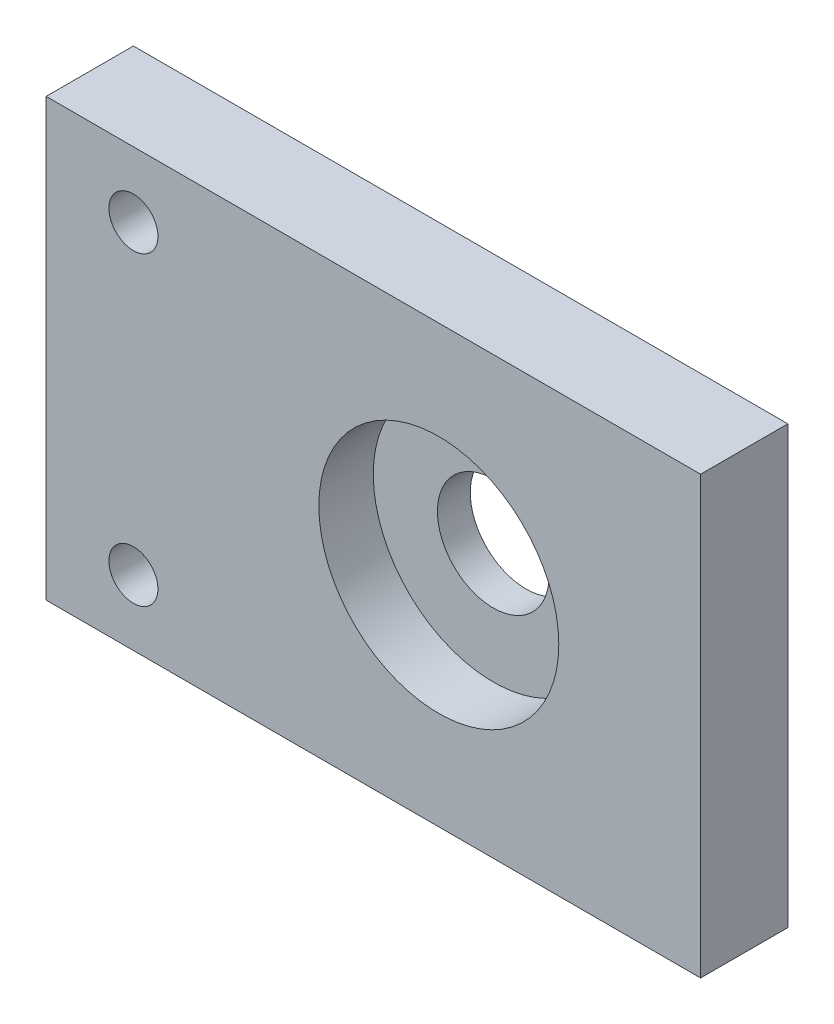
ISO-10303-21;
HEADER;
FILE_DESCRIPTION(('STEP AP214'),'2;1');
FILE_NAME('part.step','',(''),(''),'','','');
FILE_SCHEMA(('AUTOMOTIVE_DESIGN { 1 0 10303 214 1 1 1 1 }'));
ENDSEC;
DATA;
#1=APPLICATION_CONTEXT('core data for automotive mechanical design processes');
#2=APPLICATION_PROTOCOL_DEFINITION('international standard','automotive_design',2000,#1);
#3=PRODUCT_CONTEXT('',#1,'mechanical');
#4=PRODUCT('Part','Part','',(#3));
#5=PRODUCT_RELATED_PRODUCT_CATEGORY('part','',(#4));
#6=PRODUCT_DEFINITION_FORMATION('','',#4);
#7=PRODUCT_DEFINITION_CONTEXT('part definition',#1,'design');
#8=PRODUCT_DEFINITION('design','',#6,#7);
#9=PRODUCT_DEFINITION_SHAPE('','',#8);
#10=(LENGTH_UNIT() NAMED_UNIT(*) SI_UNIT(.MILLI.,.METRE.));
#11=(NAMED_UNIT(*) PLANE_ANGLE_UNIT() SI_UNIT($,.RADIAN.));
#12=(NAMED_UNIT(*) SI_UNIT($,.STERADIAN.) SOLID_ANGLE_UNIT());
#13=UNCERTAINTY_MEASURE_WITH_UNIT(LENGTH_MEASURE(1.E-05),#10,'distance_accuracy_value','');
#14=(GEOMETRIC_REPRESENTATION_CONTEXT(3) GLOBAL_UNCERTAINTY_ASSIGNED_CONTEXT((#13)) GLOBAL_UNIT_ASSIGNED_CONTEXT((#10,
#11,#12)) REPRESENTATION_CONTEXT('',''));
#15=CARTESIAN_POINT('',(0.,0.,0.));
#16=DIRECTION('',(0.,0.,1.));
#17=DIRECTION('',(1.,0.,0.));
#18=AXIS2_PLACEMENT_3D('',#15,#16,#17);
#19=CARTESIAN_POINT('',(0.,0.,12.7));
#20=DIRECTION('',(1.,0.,0.));
#21=DIRECTION('',(0.,0.,-1.));
#22=AXIS2_PLACEMENT_3D('',#19,#20,#21);
#23=PLANE('',#22);
#24=DIRECTION('',(0.,-1.,0.));
#25=VECTOR('',#24,1.);
#26=CARTESIAN_POINT('',(0.,0.,0.));
#27=LINE('',#26,#25);
#28=CARTESIAN_POINT('',(0.,63.5,0.));
#29=VERTEX_POINT('',#28);
#30=CARTESIAN_POINT('',(0.,0.,0.));
#31=VERTEX_POINT('',#30);
#32=EDGE_CURVE('E97',#29,#31,#27,.T.);
#33=ORIENTED_EDGE('',*,*,#32,.T.);
#34=DIRECTION('',(0.,0.,-1.));
#35=VECTOR('',#34,1.);
#36=CARTESIAN_POINT('',(0.,0.,12.7));
#37=LINE('',#36,#35);
#38=CARTESIAN_POINT('',(0.,0.,12.7));
#39=VERTEX_POINT('',#38);
#40=EDGE_CURVE('E11',#39,#31,#37,.T.);
#41=ORIENTED_EDGE('',*,*,#40,.F.);
#42=DIRECTION('',(0.,-1.,0.));
#43=VECTOR('',#42,1.);
#44=CARTESIAN_POINT('',(0.,0.,12.7));
#45=LINE('',#44,#43);
#46=CARTESIAN_POINT('',(0.,63.5,12.7));
#47=VERTEX_POINT('',#46);
#48=EDGE_CURVE('E85',#47,#39,#45,.T.);
#49=ORIENTED_EDGE('',*,*,#48,.F.);
#50=DIRECTION('',(0.,0.,-1.));
#51=VECTOR('',#50,1.);
#52=CARTESIAN_POINT('',(0.,63.5,12.7));
#53=LINE('',#52,#51);
#54=EDGE_CURVE('E93',#47,#29,#53,.T.);
#55=ORIENTED_EDGE('',*,*,#54,.T.);
#56=EDGE_LOOP('',(#33,#41,#49,#55));
#57=FACE_BOUND('',#56,.T.);
#58=ADVANCED_FACE('F34',(#57),#23,.F.);
#59=CARTESIAN_POINT('',(0.,0.,12.7));
#60=DIRECTION('',(0.,1.,0.));
#61=DIRECTION('',(0.,0.,1.));
#62=AXIS2_PLACEMENT_3D('',#59,#60,#61);
#63=PLANE('',#62);
#64=DIRECTION('',(1.,0.,0.));
#65=VECTOR('',#64,1.);
#66=CARTESIAN_POINT('',(0.,0.,0.));
#67=LINE('',#66,#65);
#68=CARTESIAN_POINT('',(95.25,0.,0.));
#69=VERTEX_POINT('',#68);
#70=EDGE_CURVE('E89',#31,#69,#67,.T.);
#71=ORIENTED_EDGE('',*,*,#70,.T.);
#72=DIRECTION('',(0.,0.,-1.));
#73=VECTOR('',#72,1.);
#74=CARTESIAN_POINT('',(95.25,0.,12.7));
#75=LINE('',#74,#73);
#76=CARTESIAN_POINT('',(95.25,0.,12.7));
#77=VERTEX_POINT('',#76);
#78=EDGE_CURVE('E42',#77,#69,#75,.T.);
#79=ORIENTED_EDGE('',*,*,#78,.F.);
#80=DIRECTION('',(1.,0.,0.));
#81=VECTOR('',#80,1.);
#82=CARTESIAN_POINT('',(0.,0.,12.7));
#83=LINE('',#82,#81);
#84=EDGE_CURVE('E80',#39,#77,#83,.T.);
#85=ORIENTED_EDGE('',*,*,#84,.F.);
#86=ORIENTED_EDGE('',*,*,#40,.T.);
#87=EDGE_LOOP('',(#71,#79,#85,#86));
#88=FACE_BOUND('',#87,.T.);
#89=ADVANCED_FACE('F88',(#88),#63,.F.);
#90=CARTESIAN_POINT('',(95.25,0.,12.7));
#91=DIRECTION('',(-1.,0.,0.));
#92=DIRECTION('',(0.,0.,1.));
#93=AXIS2_PLACEMENT_3D('',#90,#91,#92);
#94=PLANE('',#93);
#95=DIRECTION('',(0.,1.,0.));
#96=VECTOR('',#95,1.);
#97=CARTESIAN_POINT('',(95.25,0.,0.));
#98=LINE('',#97,#96);
#99=CARTESIAN_POINT('',(95.25,63.5,0.));
#100=VERTEX_POINT('',#99);
#101=EDGE_CURVE('E67',#69,#100,#98,.T.);
#102=ORIENTED_EDGE('',*,*,#101,.T.);
#103=DIRECTION('',(0.,0.,-1.));
#104=VECTOR('',#103,1.);
#105=CARTESIAN_POINT('',(95.25,63.5,12.7));
#106=LINE('',#105,#104);
#107=CARTESIAN_POINT('',(95.25,63.5,12.7));
#108=VERTEX_POINT('',#107);
#109=EDGE_CURVE('E90',#108,#100,#106,.T.);
#110=ORIENTED_EDGE('',*,*,#109,.F.);
#111=DIRECTION('',(0.,1.,0.));
#112=VECTOR('',#111,1.);
#113=CARTESIAN_POINT('',(95.25,0.,12.7));
#114=LINE('',#113,#112);
#115=EDGE_CURVE('E83',#77,#108,#114,.T.);
#116=ORIENTED_EDGE('',*,*,#115,.F.);
#117=ORIENTED_EDGE('',*,*,#78,.T.);
#118=EDGE_LOOP('',(#102,#110,#116,#117));
#119=FACE_BOUND('',#118,.T.);
#120=ADVANCED_FACE('F91',(#119),#94,.F.);
#121=CARTESIAN_POINT('',(0.,63.5,12.7));
#122=DIRECTION('',(0.,-1.,0.));
#123=DIRECTION('',(0.,0.,-1.));
#124=AXIS2_PLACEMENT_3D('',#121,#122,#123);
#125=PLANE('',#124);
#126=DIRECTION('',(-1.,0.,0.));
#127=VECTOR('',#126,1.);
#128=CARTESIAN_POINT('',(0.,63.5,0.));
#129=LINE('',#128,#127);
#130=EDGE_CURVE('E73',#100,#29,#129,.T.);
#131=ORIENTED_EDGE('',*,*,#130,.T.);
#132=ORIENTED_EDGE('',*,*,#54,.F.);
#133=DIRECTION('',(-1.,0.,0.));
#134=VECTOR('',#133,1.);
#135=CARTESIAN_POINT('',(0.,63.5,12.7));
#136=LINE('',#135,#134);
#137=EDGE_CURVE('E50',#108,#47,#136,.T.);
#138=ORIENTED_EDGE('',*,*,#137,.F.);
#139=ORIENTED_EDGE('',*,*,#109,.T.);
#140=EDGE_LOOP('',(#131,#132,#138,#139));
#141=FACE_BOUND('',#140,.T.);
#142=ADVANCED_FACE('F105',(#141),#125,.F.);
#143=CARTESIAN_POINT('',(0.,63.5,12.7));
#144=DIRECTION('',(0.,0.,-1.));
#145=DIRECTION('',(-1.,0.,0.));
#146=AXIS2_PLACEMENT_3D('',#143,#144,#145);
#147=PLANE('',#146);
#148=CARTESIAN_POINT('',(57.15,31.75,12.7));
#149=DIRECTION('',(0.,0.,1.));
#150=DIRECTION('',(1.,0.,0.));
#151=AXIS2_PLACEMENT_3D('',#148,#149,#150);
#152=CIRCLE('',#151,17.4625);
#153=CARTESIAN_POINT('',(74.6125,31.75,12.7));
#154=VERTEX_POINT('',#153);
#155=EDGE_CURVE('E143',#154,#154,#152,.T.);
#156=ORIENTED_EDGE('',*,*,#155,.F.);
#157=EDGE_LOOP('',(#156));
#158=FACE_BOUND('',#157,.T.);
#159=CARTESIAN_POINT('',(12.7,53.975,12.7));
#160=DIRECTION('',(0.,0.,-1.));
#161=DIRECTION('',(-1.,0.,0.));
#162=AXIS2_PLACEMENT_3D('',#159,#160,#161);
#163=CIRCLE('',#162,3.57123999999999);
#164=CARTESIAN_POINT('',(9.12876000000001,53.975,12.7));
#165=VERTEX_POINT('',#164);
#166=EDGE_CURVE('E122',#165,#165,#163,.T.);
#167=ORIENTED_EDGE('',*,*,#166,.T.);
#168=EDGE_LOOP('',(#167));
#169=FACE_BOUND('',#168,.T.);
#170=CARTESIAN_POINT('',(12.7,9.525,12.7));
#171=DIRECTION('',(0.,0.,-1.));
#172=DIRECTION('',(-1.,0.,0.));
#173=AXIS2_PLACEMENT_3D('',#170,#171,#172);
#174=CIRCLE('',#173,3.57124);
#175=CARTESIAN_POINT('',(9.12876,9.525,12.7));
#176=VERTEX_POINT('',#175);
#177=EDGE_CURVE('E100',#176,#176,#174,.T.);
#178=ORIENTED_EDGE('',*,*,#177,.T.);
#179=EDGE_LOOP('',(#178));
#180=FACE_BOUND('',#179,.T.);
#181=ORIENTED_EDGE('',*,*,#48,.T.);
#182=ORIENTED_EDGE('',*,*,#84,.T.);
#183=ORIENTED_EDGE('',*,*,#115,.T.);
#184=ORIENTED_EDGE('',*,*,#137,.T.);
#185=EDGE_LOOP('',(#181,#182,#183,#184));
#186=FACE_BOUND('',#185,.T.);
#187=ADVANCED_FACE('F81',(#158,#169,#180,#186),#147,.F.);
#188=CARTESIAN_POINT('',(0.,63.5,0.));
#189=DIRECTION('',(0.,0.,-1.));
#190=DIRECTION('',(-1.,0.,0.));
#191=AXIS2_PLACEMENT_3D('',#188,#189,#190);
#192=PLANE('',#191);
#193=CARTESIAN_POINT('',(57.15,31.75,0.));
#194=DIRECTION('',(0.,0.,1.));
#195=DIRECTION('',(1.,0.,0.));
#196=AXIS2_PLACEMENT_3D('',#193,#194,#195);
#197=CIRCLE('',#196,8.128);
#198=CARTESIAN_POINT('',(65.278,31.75,0.));
#199=VERTEX_POINT('',#198);
#200=EDGE_CURVE('E134',#199,#199,#197,.T.);
#201=ORIENTED_EDGE('',*,*,#200,.T.);
#202=EDGE_LOOP('',(#201));
#203=FACE_BOUND('',#202,.T.);
#204=CARTESIAN_POINT('',(12.7,53.975,0.));
#205=DIRECTION('',(0.,0.,-1.));
#206=DIRECTION('',(-1.,0.,0.));
#207=AXIS2_PLACEMENT_3D('',#204,#205,#206);
#208=CIRCLE('',#207,5.55625);
#209=CARTESIAN_POINT('',(7.14375000000001,53.975,0.));
#210=VERTEX_POINT('',#209);
#211=EDGE_CURVE('E131',#210,#210,#208,.T.);
#212=ORIENTED_EDGE('',*,*,#211,.F.);
#213=EDGE_LOOP('',(#212));
#214=FACE_BOUND('',#213,.T.);
#215=CARTESIAN_POINT('',(12.7,9.525,0.));
#216=DIRECTION('',(0.,0.,-1.));
#217=DIRECTION('',(-1.,0.,0.));
#218=AXIS2_PLACEMENT_3D('',#215,#216,#217);
#219=CIRCLE('',#218,5.55625);
#220=CARTESIAN_POINT('',(7.14375,9.525,0.));
#221=VERTEX_POINT('',#220);
#222=EDGE_CURVE('E119',#221,#221,#219,.T.);
#223=ORIENTED_EDGE('',*,*,#222,.F.);
#224=EDGE_LOOP('',(#223));
#225=FACE_BOUND('',#224,.T.);
#226=ORIENTED_EDGE('',*,*,#32,.F.);
#227=ORIENTED_EDGE('',*,*,#130,.F.);
#228=ORIENTED_EDGE('',*,*,#101,.F.);
#229=ORIENTED_EDGE('',*,*,#70,.F.);
#230=EDGE_LOOP('',(#226,#227,#228,#229));
#231=FACE_BOUND('',#230,.T.);
#232=ADVANCED_FACE('F108',(#203,#214,#225,#231),#192,.T.);
#233=CARTESIAN_POINT('',(12.7,9.525,0.));
#234=DIRECTION('',(0.,0.,-1.));
#235=DIRECTION('',(-1.,0.,0.));
#236=AXIS2_PLACEMENT_3D('',#233,#234,#235);
#237=CYLINDRICAL_SURFACE('',#236,3.57124);
#238=ORIENTED_EDGE('',*,*,#177,.F.);
#239=EDGE_LOOP('',(#238));
#240=FACE_BOUND('',#239,.T.);
#241=CARTESIAN_POINT('',(12.7,9.525,6.35));
#242=DIRECTION('',(0.,0.,-1.));
#243=DIRECTION('',(-1.,0.,0.));
#244=AXIS2_PLACEMENT_3D('',#241,#242,#243);
#245=CIRCLE('',#244,3.57124);
#246=CARTESIAN_POINT('',(9.12876,9.525,6.35));
#247=VERTEX_POINT('',#246);
#248=EDGE_CURVE('E113',#247,#247,#245,.T.);
#249=ORIENTED_EDGE('',*,*,#248,.T.);
#250=EDGE_LOOP('',(#249));
#251=FACE_BOUND('',#250,.T.);
#252=ADVANCED_FACE('F156',(#240,#251),#237,.F.);
#253=CARTESIAN_POINT('',(16.27124,9.525,6.35));
#254=DIRECTION('',(0.,0.,1.));
#255=DIRECTION('',(1.,0.,0.));
#256=AXIS2_PLACEMENT_3D('',#253,#254,#255);
#257=PLANE('',#256);
#258=ORIENTED_EDGE('',*,*,#248,.F.);
#259=EDGE_LOOP('',(#258));
#260=FACE_BOUND('',#259,.T.);
#261=CARTESIAN_POINT('',(12.7,9.525,6.35));
#262=DIRECTION('',(0.,0.,-1.));
#263=DIRECTION('',(-1.,0.,0.));
#264=AXIS2_PLACEMENT_3D('',#261,#262,#263);
#265=CIRCLE('',#264,5.55625);
#266=CARTESIAN_POINT('',(7.14375,9.525,6.35));
#267=VERTEX_POINT('',#266);
#268=EDGE_CURVE('E116',#267,#267,#265,.T.);
#269=ORIENTED_EDGE('',*,*,#268,.T.);
#270=EDGE_LOOP('',(#269));
#271=FACE_BOUND('',#270,.T.);
#272=ADVANCED_FACE('F159',(#260,#271),#257,.F.);
#273=CARTESIAN_POINT('',(12.7,9.525,0.));
#274=DIRECTION('',(0.,0.,-1.));
#275=DIRECTION('',(-1.,0.,0.));
#276=AXIS2_PLACEMENT_3D('',#273,#274,#275);
#277=CYLINDRICAL_SURFACE('',#276,5.55625);
#278=ORIENTED_EDGE('',*,*,#268,.F.);
#279=EDGE_LOOP('',(#278));
#280=FACE_BOUND('',#279,.T.);
#281=ORIENTED_EDGE('',*,*,#222,.T.);
#282=EDGE_LOOP('',(#281));
#283=FACE_BOUND('',#282,.T.);
#284=ADVANCED_FACE('F165',(#280,#283),#277,.F.);
#285=CARTESIAN_POINT('',(12.7,53.975,0.));
#286=DIRECTION('',(0.,0.,-1.));
#287=DIRECTION('',(-1.,0.,0.));
#288=AXIS2_PLACEMENT_3D('',#285,#286,#287);
#289=CYLINDRICAL_SURFACE('',#288,3.57124);
#290=ORIENTED_EDGE('',*,*,#166,.F.);
#291=EDGE_LOOP('',(#290));
#292=FACE_BOUND('',#291,.T.);
#293=CARTESIAN_POINT('',(12.7,53.975,6.35));
#294=DIRECTION('',(0.,0.,-1.));
#295=DIRECTION('',(-1.,0.,0.));
#296=AXIS2_PLACEMENT_3D('',#293,#294,#295);
#297=CIRCLE('',#296,3.57124);
#298=CARTESIAN_POINT('',(9.12876000000001,53.975,6.35));
#299=VERTEX_POINT('',#298);
#300=EDGE_CURVE('E125',#299,#299,#297,.T.);
#301=ORIENTED_EDGE('',*,*,#300,.T.);
#302=EDGE_LOOP('',(#301));
#303=FACE_BOUND('',#302,.T.);
#304=ADVANCED_FACE('F171',(#292,#303),#289,.F.);
#305=CARTESIAN_POINT('',(16.27124,53.975,6.35));
#306=DIRECTION('',(0.,0.,1.));
#307=DIRECTION('',(1.,0.,0.));
#308=AXIS2_PLACEMENT_3D('',#305,#306,#307);
#309=PLANE('',#308);
#310=ORIENTED_EDGE('',*,*,#300,.F.);
#311=EDGE_LOOP('',(#310));
#312=FACE_BOUND('',#311,.T.);
#313=CARTESIAN_POINT('',(12.7,53.975,6.35));
#314=DIRECTION('',(0.,0.,-1.));
#315=DIRECTION('',(-1.,0.,0.));
#316=AXIS2_PLACEMENT_3D('',#313,#314,#315);
#317=CIRCLE('',#316,5.55625);
#318=CARTESIAN_POINT('',(7.14375000000001,53.975,6.35));
#319=VERTEX_POINT('',#318);
#320=EDGE_CURVE('E128',#319,#319,#317,.T.);
#321=ORIENTED_EDGE('',*,*,#320,.T.);
#322=EDGE_LOOP('',(#321));
#323=FACE_BOUND('',#322,.T.);
#324=ADVANCED_FACE('F247',(#312,#323),#309,.F.);
#325=CARTESIAN_POINT('',(12.7,53.975,0.));
#326=DIRECTION('',(0.,0.,-1.));
#327=DIRECTION('',(-1.,0.,0.));
#328=AXIS2_PLACEMENT_3D('',#325,#326,#327);
#329=CYLINDRICAL_SURFACE('',#328,5.55625);
#330=ORIENTED_EDGE('',*,*,#320,.F.);
#331=EDGE_LOOP('',(#330));
#332=FACE_BOUND('',#331,.T.);
#333=ORIENTED_EDGE('',*,*,#211,.T.);
#334=EDGE_LOOP('',(#333));
#335=FACE_BOUND('',#334,.T.);
#336=ADVANCED_FACE('F206',(#332,#335),#329,.F.);
#337=CARTESIAN_POINT('',(57.15,31.75,12.7));
#338=DIRECTION('',(0.,0.,1.));
#339=DIRECTION('',(1.,0.,0.));
#340=AXIS2_PLACEMENT_3D('',#337,#338,#339);
#341=CYLINDRICAL_SURFACE('',#340,8.128);
#342=ORIENTED_EDGE('',*,*,#200,.F.);
#343=EDGE_LOOP('',(#342));
#344=FACE_BOUND('',#343,.T.);
#345=CARTESIAN_POINT('',(57.15,31.75,4.7752));
#346=DIRECTION('',(0.,0.,1.));
#347=DIRECTION('',(1.,0.,0.));
#348=AXIS2_PLACEMENT_3D('',#345,#346,#347);
#349=CIRCLE('',#348,8.128);
#350=CARTESIAN_POINT('',(65.278,31.75,4.7752));
#351=VERTEX_POINT('',#350);
#352=EDGE_CURVE('E137',#351,#351,#349,.T.);
#353=ORIENTED_EDGE('',*,*,#352,.T.);
#354=EDGE_LOOP('',(#353));
#355=FACE_BOUND('',#354,.T.);
#356=ADVANCED_FACE('F216',(#344,#355),#341,.F.);
#357=CARTESIAN_POINT('',(65.278,31.75,4.7752));
#358=DIRECTION('',(0.,0.,-1.));
#359=DIRECTION('',(-1.,0.,0.));
#360=AXIS2_PLACEMENT_3D('',#357,#358,#359);
#361=PLANE('',#360);
#362=ORIENTED_EDGE('',*,*,#352,.F.);
#363=EDGE_LOOP('',(#362));
#364=FACE_BOUND('',#363,.T.);
#365=CARTESIAN_POINT('',(57.15,31.75,4.7752));
#366=DIRECTION('',(0.,0.,1.));
#367=DIRECTION('',(1.,0.,0.));
#368=AXIS2_PLACEMENT_3D('',#365,#366,#367);
#369=CIRCLE('',#368,17.4625);
#370=CARTESIAN_POINT('',(74.6125,31.75,4.7752));
#371=VERTEX_POINT('',#370);
#372=EDGE_CURVE('E140',#371,#371,#369,.T.);
#373=ORIENTED_EDGE('',*,*,#372,.T.);
#374=EDGE_LOOP('',(#373));
#375=FACE_BOUND('',#374,.T.);
#376=ADVANCED_FACE('F221',(#364,#375),#361,.F.);
#377=CARTESIAN_POINT('',(57.15,31.75,12.7));
#378=DIRECTION('',(0.,0.,1.));
#379=DIRECTION('',(1.,0.,0.));
#380=AXIS2_PLACEMENT_3D('',#377,#378,#379);
#381=CYLINDRICAL_SURFACE('',#380,17.4625);
#382=ORIENTED_EDGE('',*,*,#372,.F.);
#383=EDGE_LOOP('',(#382));
#384=FACE_BOUND('',#383,.T.);
#385=ORIENTED_EDGE('',*,*,#155,.T.);
#386=EDGE_LOOP('',(#385));
#387=FACE_BOUND('',#386,.T.);
#388=ADVANCED_FACE('F147',(#384,#387),#381,.F.);
#389=CLOSED_SHELL('',(#58,#89,#120,#142,#187,#232,#252,#272,#284,#304,#324,#336,#356,#376,#388));
#390=MANIFOLD_SOLID_BREP('B2',#389);
#391=ADVANCED_BREP_SHAPE_REPRESENTATION('',(#18,#390),#14);
#392=SHAPE_DEFINITION_REPRESENTATION(#9,#391);
ENDSEC;
END-ISO-10303-21;
